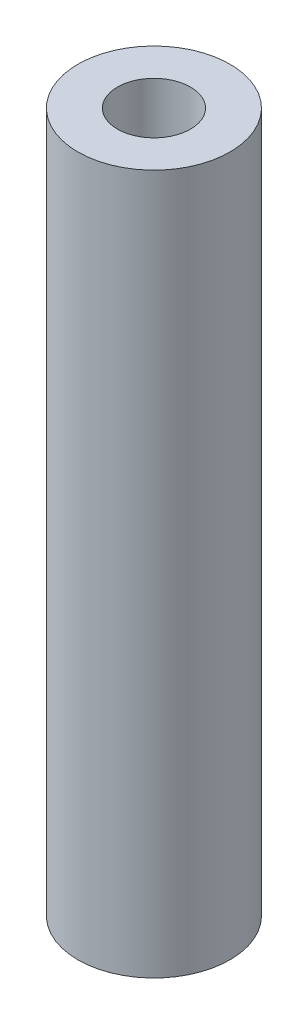
ISO-10303-21;
HEADER;
FILE_DESCRIPTION(('STEP AP214'),'2;1');
FILE_NAME('part.step','',(''),(''),'','','');
FILE_SCHEMA(('AUTOMOTIVE_DESIGN { 1 0 10303 214 1 1 1 1 }'));
ENDSEC;
DATA;
#1=APPLICATION_CONTEXT('core data for automotive mechanical design processes');
#2=APPLICATION_PROTOCOL_DEFINITION('international standard','automotive_design',2000,#1);
#3=PRODUCT_CONTEXT('',#1,'mechanical');
#4=PRODUCT('Part','Part','',(#3));
#5=PRODUCT_RELATED_PRODUCT_CATEGORY('part','',(#4));
#6=PRODUCT_DEFINITION_FORMATION('','',#4);
#7=PRODUCT_DEFINITION_CONTEXT('part definition',#1,'design');
#8=PRODUCT_DEFINITION('design','',#6,#7);
#9=PRODUCT_DEFINITION_SHAPE('','',#8);
#10=(LENGTH_UNIT() NAMED_UNIT(*) SI_UNIT(.MILLI.,.METRE.));
#11=(NAMED_UNIT(*) PLANE_ANGLE_UNIT() SI_UNIT($,.RADIAN.));
#12=(NAMED_UNIT(*) SI_UNIT($,.STERADIAN.) SOLID_ANGLE_UNIT());
#13=UNCERTAINTY_MEASURE_WITH_UNIT(LENGTH_MEASURE(1.E-05),#10,'distance_accuracy_value','');
#14=(GEOMETRIC_REPRESENTATION_CONTEXT(3) GLOBAL_UNCERTAINTY_ASSIGNED_CONTEXT((#13)) GLOBAL_UNIT_ASSIGNED_CONTEXT((#10,
#11,#12)) REPRESENTATION_CONTEXT('',''));
#15=CARTESIAN_POINT('',(0.,0.,0.));
#16=DIRECTION('',(0.,0.,1.));
#17=DIRECTION('',(1.,0.,0.));
#18=AXIS2_PLACEMENT_3D('',#15,#16,#17);
#19=CARTESIAN_POINT('',(0.,23.,0.));
#20=DIRECTION('',(0.,1.,0.));
#21=DIRECTION('',(0.,0.,1.));
#22=AXIS2_PLACEMENT_3D('',#19,#20,#21);
#23=PLANE('',#22);
#24=CARTESIAN_POINT('',(0.,23.,0.));
#25=DIRECTION('',(0.,1.,0.));
#26=DIRECTION('',(0.,0.,1.));
#27=AXIS2_PLACEMENT_3D('',#24,#25,#26);
#28=CIRCLE('',#27,2.5);
#29=CARTESIAN_POINT('',(0.,23.,2.5));
#30=VERTEX_POINT('',#29);
#31=EDGE_CURVE('E10',#30,#30,#28,.T.);
#32=ORIENTED_EDGE('',*,*,#31,.T.);
#33=EDGE_LOOP('',(#32));
#34=FACE_BOUND('',#33,.T.);
#35=CARTESIAN_POINT('',(0.,23.,0.));
#36=DIRECTION('',(0.,1.,0.));
#37=DIRECTION('',(0.,0.,1.));
#38=AXIS2_PLACEMENT_3D('',#35,#36,#37);
#39=CIRCLE('',#38,1.2);
#40=CARTESIAN_POINT('',(0.,23.,1.2));
#41=VERTEX_POINT('',#40);
#42=EDGE_CURVE('E46',#41,#41,#39,.T.);
#43=ORIENTED_EDGE('',*,*,#42,.F.);
#44=EDGE_LOOP('',(#43));
#45=FACE_BOUND('',#44,.T.);
#46=ADVANCED_FACE('F35',(#34,#45),#23,.T.);
#47=CARTESIAN_POINT('',(0.,0.,0.));
#48=DIRECTION('',(0.,1.,0.));
#49=DIRECTION('',(0.,0.,1.));
#50=AXIS2_PLACEMENT_3D('',#47,#48,#49);
#51=PLANE('',#50);
#52=CARTESIAN_POINT('',(0.,0.,0.));
#53=DIRECTION('',(0.,1.,0.));
#54=DIRECTION('',(0.,0.,1.));
#55=AXIS2_PLACEMENT_3D('',#52,#53,#54);
#56=CIRCLE('',#55,2.5);
#57=CARTESIAN_POINT('',(0.,0.,2.5));
#58=VERTEX_POINT('',#57);
#59=EDGE_CURVE('E39',#58,#58,#56,.T.);
#60=ORIENTED_EDGE('',*,*,#59,.F.);
#61=EDGE_LOOP('',(#60));
#62=FACE_BOUND('',#61,.T.);
#63=CARTESIAN_POINT('',(0.,0.,0.));
#64=DIRECTION('',(0.,1.,0.));
#65=DIRECTION('',(0.,0.,1.));
#66=AXIS2_PLACEMENT_3D('',#63,#64,#65);
#67=CIRCLE('',#66,1.2);
#68=CARTESIAN_POINT('',(0.,0.,1.2));
#69=VERTEX_POINT('',#68);
#70=EDGE_CURVE('E48',#69,#69,#67,.T.);
#71=ORIENTED_EDGE('',*,*,#70,.T.);
#72=EDGE_LOOP('',(#71));
#73=FACE_BOUND('',#72,.T.);
#74=ADVANCED_FACE('F58',(#62,#73),#51,.F.);
#75=CARTESIAN_POINT('',(0.,23.,0.));
#76=DIRECTION('',(0.,-1.,0.));
#77=DIRECTION('',(0.,0.,-1.));
#78=AXIS2_PLACEMENT_3D('',#75,#76,#77);
#79=CYLINDRICAL_SURFACE('',#78,2.5);
#80=ORIENTED_EDGE('',*,*,#31,.F.);
#81=EDGE_LOOP('',(#80));
#82=FACE_BOUND('',#81,.T.);
#83=ORIENTED_EDGE('',*,*,#59,.T.);
#84=EDGE_LOOP('',(#83));
#85=FACE_BOUND('',#84,.T.);
#86=ADVANCED_FACE('F37',(#82,#85),#79,.T.);
#87=CARTESIAN_POINT('',(0.,23.,0.));
#88=DIRECTION('',(0.,-1.,0.));
#89=DIRECTION('',(0.,0.,-1.));
#90=AXIS2_PLACEMENT_3D('',#87,#88,#89);
#91=CYLINDRICAL_SURFACE('',#90,1.2);
#92=ORIENTED_EDGE('',*,*,#42,.T.);
#93=EDGE_LOOP('',(#92));
#94=FACE_BOUND('',#93,.T.);
#95=ORIENTED_EDGE('',*,*,#70,.F.);
#96=EDGE_LOOP('',(#95));
#97=FACE_BOUND('',#96,.T.);
#98=ADVANCED_FACE('F54',(#94,#97),#91,.F.);
#99=CLOSED_SHELL('',(#46,#74,#86,#98));
#100=MANIFOLD_SOLID_BREP('B2',#99);
#101=ADVANCED_BREP_SHAPE_REPRESENTATION('',(#18,#100),#14);
#102=SHAPE_DEFINITION_REPRESENTATION(#9,#101);
ENDSEC;
END-ISO-10303-21;
